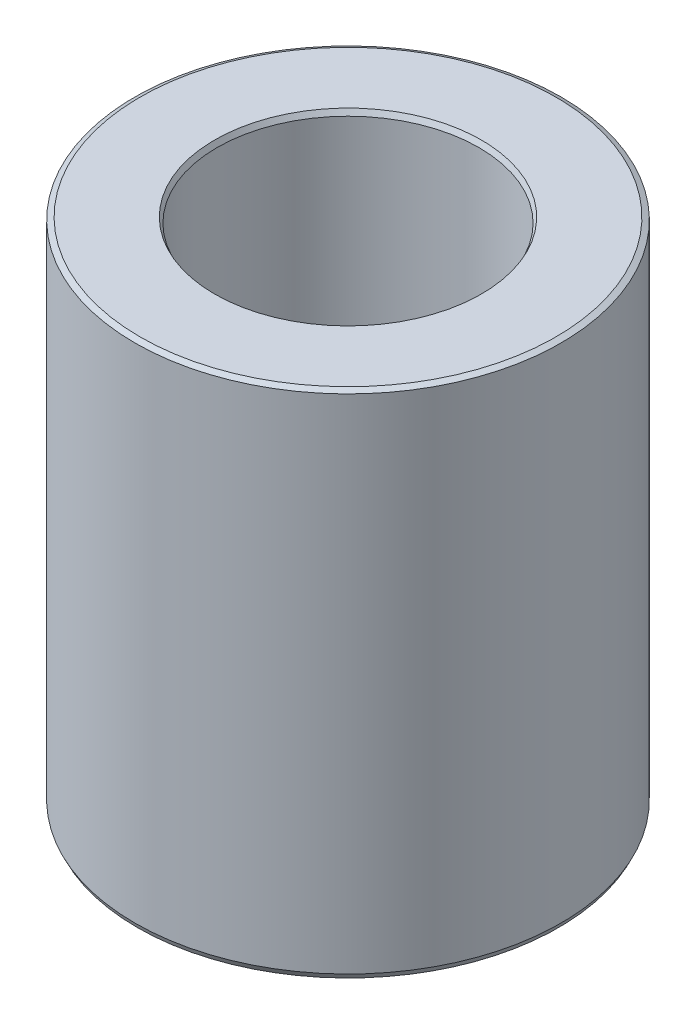
ISO-10303-21;
HEADER;
FILE_DESCRIPTION(('STEP AP214'),'2;1');
FILE_NAME('part.step','',(''),(''),'','','');
FILE_SCHEMA(('AUTOMOTIVE_DESIGN { 1 0 10303 214 1 1 1 1 }'));
ENDSEC;
DATA;
#1=APPLICATION_CONTEXT('core data for automotive mechanical design processes');
#2=APPLICATION_PROTOCOL_DEFINITION('international standard','automotive_design',2000,#1);
#3=PRODUCT_CONTEXT('',#1,'mechanical');
#4=PRODUCT('Part','Part','',(#3));
#5=PRODUCT_RELATED_PRODUCT_CATEGORY('part','',(#4));
#6=PRODUCT_DEFINITION_FORMATION('','',#4);
#7=PRODUCT_DEFINITION_CONTEXT('part definition',#1,'design');
#8=PRODUCT_DEFINITION('design','',#6,#7);
#9=PRODUCT_DEFINITION_SHAPE('','',#8);
#10=(LENGTH_UNIT() NAMED_UNIT(*) SI_UNIT(.MILLI.,.METRE.));
#11=(NAMED_UNIT(*) PLANE_ANGLE_UNIT() SI_UNIT($,.RADIAN.));
#12=(NAMED_UNIT(*) SI_UNIT($,.STERADIAN.) SOLID_ANGLE_UNIT());
#13=UNCERTAINTY_MEASURE_WITH_UNIT(LENGTH_MEASURE(1.E-05),#10,'distance_accuracy_value','');
#14=(GEOMETRIC_REPRESENTATION_CONTEXT(3) GLOBAL_UNCERTAINTY_ASSIGNED_CONTEXT((#13)) GLOBAL_UNIT_ASSIGNED_CONTEXT((#10,
#11,#12)) REPRESENTATION_CONTEXT('',''));
#15=CARTESIAN_POINT('',(0.,0.,0.));
#16=DIRECTION('',(0.,0.,1.));
#17=DIRECTION('',(1.,0.,0.));
#18=AXIS2_PLACEMENT_3D('',#15,#16,#17);
#19=CARTESIAN_POINT('',(0.,143.663507820876,0.));
#20=DIRECTION('',(0.,-1.,0.));
#21=DIRECTION('',(0.,0.,-1.));
#22=AXIS2_PLACEMENT_3D('',#19,#20,#21);
#23=CYLINDRICAL_SURFACE('',#22,60.);
#24=CARTESIAN_POINT('',(0.,1.47878063690801,0.));
#25=DIRECTION('',(0.,1.,0.));
#26=DIRECTION('',(0.,0.,1.));
#27=AXIS2_PLACEMENT_3D('',#24,#25,#26);
#28=CIRCLE('',#27,60.);
#29=CARTESIAN_POINT('',(0.,1.47878063690801,60.));
#30=VERTEX_POINT('',#29);
#31=EDGE_CURVE('E10',#30,#30,#28,.T.);
#32=ORIENTED_EDGE('',*,*,#31,.T.);
#33=EDGE_LOOP('',(#32));
#34=FACE_BOUND('',#33,.T.);
#35=CARTESIAN_POINT('',(0.,142.946231781575,0.));
#36=DIRECTION('',(0.,1.,0.));
#37=DIRECTION('',(0.,0.,1.));
#38=AXIS2_PLACEMENT_3D('',#35,#36,#37);
#39=CIRCLE('',#38,60.);
#40=CARTESIAN_POINT('',(0.,142.946231781575,60.));
#41=VERTEX_POINT('',#40);
#42=EDGE_CURVE('E50',#41,#41,#39,.F.);
#43=ORIENTED_EDGE('',*,*,#42,.T.);
#44=EDGE_LOOP('',(#43));
#45=FACE_BOUND('',#44,.T.);
#46=ADVANCED_FACE('F39',(#34,#45),#23,.T.);
#47=CARTESIAN_POINT('',(0.,143.663507820876,0.));
#48=DIRECTION('',(0.,1.,0.));
#49=DIRECTION('',(0.,0.,1.));
#50=AXIS2_PLACEMENT_3D('',#47,#48,#49);
#51=PLANE('',#50);
#52=CARTESIAN_POINT('',(0.,143.663507820876,0.));
#53=DIRECTION('',(0.,1.,0.));
#54=DIRECTION('',(0.,0.,1.));
#55=AXIS2_PLACEMENT_3D('',#52,#53,#54);
#56=CIRCLE('',#55,37.5738981580556);
#57=CARTESIAN_POINT('',(0.,143.663507820876,37.5738981580556));
#58=VERTEX_POINT('',#57);
#59=EDGE_CURVE('E58',#58,#58,#56,.F.);
#60=ORIENTED_EDGE('',*,*,#59,.T.);
#61=EDGE_LOOP('',(#60));
#62=FACE_BOUND('',#61,.T.);
#63=CARTESIAN_POINT('',(0.,143.663507820876,0.));
#64=DIRECTION('',(0.,1.,0.));
#65=DIRECTION('',(0.,0.,1.));
#66=AXIS2_PLACEMENT_3D('',#63,#64,#65);
#67=CIRCLE('',#66,58.5212193630918);
#68=CARTESIAN_POINT('',(0.,143.663507820876,58.5212193630918));
#69=VERTEX_POINT('',#68);
#70=EDGE_CURVE('E61',#69,#69,#67,.T.);
#71=ORIENTED_EDGE('',*,*,#70,.T.);
#72=EDGE_LOOP('',(#71));
#73=FACE_BOUND('',#72,.T.);
#74=ADVANCED_FACE('F88',(#62,#73),#51,.T.);
#75=CARTESIAN_POINT('',(0.,0.,0.));
#76=DIRECTION('',(0.,1.,0.));
#77=DIRECTION('',(0.,0.,1.));
#78=AXIS2_PLACEMENT_3D('',#75,#76,#77);
#79=PLANE('',#78);
#80=CARTESIAN_POINT('',(0.,0.,0.));
#81=DIRECTION('',(0.,1.,0.));
#82=DIRECTION('',(0.,0.,1.));
#83=AXIS2_PLACEMENT_3D('',#80,#81,#82);
#84=CIRCLE('',#83,38.335402755663);
#85=CARTESIAN_POINT('',(0.,0.,38.335402755663));
#86=VERTEX_POINT('',#85);
#87=EDGE_CURVE('E51',#86,#86,#84,.T.);
#88=ORIENTED_EDGE('',*,*,#87,.T.);
#89=EDGE_LOOP('',(#88));
#90=FACE_BOUND('',#89,.T.);
#91=CARTESIAN_POINT('',(0.,0.,0.));
#92=DIRECTION('',(0.,1.,0.));
#93=DIRECTION('',(0.,0.,1.));
#94=AXIS2_PLACEMENT_3D('',#91,#92,#93);
#95=CIRCLE('',#94,59.2827239606993);
#96=CARTESIAN_POINT('',(0.,0.,59.2827239606993));
#97=VERTEX_POINT('',#96);
#98=EDGE_CURVE('E54',#97,#97,#95,.F.);
#99=ORIENTED_EDGE('',*,*,#98,.T.);
#100=EDGE_LOOP('',(#99));
#101=FACE_BOUND('',#100,.T.);
#102=ADVANCED_FACE('F83',(#90,#101),#79,.F.);
#103=CARTESIAN_POINT('',(0.,143.663507820876,0.));
#104=DIRECTION('',(0.,-1.,0.));
#105=DIRECTION('',(0.,0.,-1.));
#106=AXIS2_PLACEMENT_3D('',#103,#104,#105);
#107=CYLINDRICAL_SURFACE('',#106,36.8566221187548);
#108=CARTESIAN_POINT('',(0.,142.184727183968,0.));
#109=DIRECTION('',(0.,1.,0.));
#110=DIRECTION('',(0.,0.,1.));
#111=AXIS2_PLACEMENT_3D('',#108,#109,#110);
#112=CIRCLE('',#111,36.8566221187548);
#113=CARTESIAN_POINT('',(0.,142.184727183968,36.8566221187548));
#114=VERTEX_POINT('',#113);
#115=EDGE_CURVE('E67',#114,#114,#112,.T.);
#116=ORIENTED_EDGE('',*,*,#115,.T.);
#117=EDGE_LOOP('',(#116));
#118=FACE_BOUND('',#117,.T.);
#119=CARTESIAN_POINT('',(0.,0.717276039300746,0.));
#120=DIRECTION('',(0.,1.,0.));
#121=DIRECTION('',(0.,0.,1.));
#122=AXIS2_PLACEMENT_3D('',#119,#120,#121);
#123=CIRCLE('',#122,36.8566221187548);
#124=CARTESIAN_POINT('',(0.,0.717276039300746,36.8566221187548));
#125=VERTEX_POINT('',#124);
#126=EDGE_CURVE('E69',#125,#125,#123,.F.);
#127=ORIENTED_EDGE('',*,*,#126,.T.);
#128=EDGE_LOOP('',(#127));
#129=FACE_BOUND('',#128,.T.);
#130=ADVANCED_FACE('F71',(#118,#129),#107,.F.);
#131=CARTESIAN_POINT('',(0.,142.184727183968,0.));
#132=DIRECTION('',(0.,1.,0.));
#133=DIRECTION('',(0.,0.,1.));
#134=AXIS2_PLACEMENT_3D('',#131,#132,#133);
#135=CONICAL_SURFACE('',#134,36.8566221187548,0.451612675432726);
#136=ORIENTED_EDGE('',*,*,#59,.F.);
#137=EDGE_LOOP('',(#136));
#138=FACE_BOUND('',#137,.T.);
#139=ORIENTED_EDGE('',*,*,#115,.F.);
#140=EDGE_LOOP('',(#139));
#141=FACE_BOUND('',#140,.T.);
#142=ADVANCED_FACE('F77',(#138,#141),#135,.F.);
#143=CARTESIAN_POINT('',(0.,0.,0.));
#144=DIRECTION('',(0.,-1.,0.));
#145=DIRECTION('',(0.,0.,-1.));
#146=AXIS2_PLACEMENT_3D('',#143,#144,#145);
#147=CONICAL_SURFACE('',#146,38.335402755663,1.11918365136215);
#148=ORIENTED_EDGE('',*,*,#126,.F.);
#149=EDGE_LOOP('',(#148));
#150=FACE_BOUND('',#149,.T.);
#151=ORIENTED_EDGE('',*,*,#87,.F.);
#152=EDGE_LOOP('',(#151));
#153=FACE_BOUND('',#152,.T.);
#154=ADVANCED_FACE('F73',(#150,#153),#147,.F.);
#155=CARTESIAN_POINT('',(0.,1.47878063690801,0.));
#156=DIRECTION('',(0.,1.,0.));
#157=DIRECTION('',(0.,0.,1.));
#158=AXIS2_PLACEMENT_3D('',#155,#156,#157);
#159=CONICAL_SURFACE('',#158,60.,0.45161267543275);
#160=ORIENTED_EDGE('',*,*,#98,.F.);
#161=EDGE_LOOP('',(#160));
#162=FACE_BOUND('',#161,.T.);
#163=ORIENTED_EDGE('',*,*,#31,.F.);
#164=EDGE_LOOP('',(#163));
#165=FACE_BOUND('',#164,.T.);
#166=ADVANCED_FACE('F76',(#162,#165),#159,.T.);
#167=CARTESIAN_POINT('',(0.,143.663507820876,0.));
#168=DIRECTION('',(0.,-1.,0.));
#169=DIRECTION('',(0.,0.,-1.));
#170=AXIS2_PLACEMENT_3D('',#167,#168,#169);
#171=CONICAL_SURFACE('',#170,58.5212193630918,1.11918365136216);
#172=ORIENTED_EDGE('',*,*,#42,.F.);
#173=EDGE_LOOP('',(#172));
#174=FACE_BOUND('',#173,.T.);
#175=ORIENTED_EDGE('',*,*,#70,.F.);
#176=EDGE_LOOP('',(#175));
#177=FACE_BOUND('',#176,.T.);
#178=ADVANCED_FACE('F45',(#174,#177),#171,.T.);
#179=CLOSED_SHELL('',(#46,#74,#102,#130,#142,#154,#166,#178));
#180=MANIFOLD_SOLID_BREP('B2',#179);
#181=ADVANCED_BREP_SHAPE_REPRESENTATION('',(#18,#180),#14);
#182=SHAPE_DEFINITION_REPRESENTATION(#9,#181);
ENDSEC;
END-ISO-10303-21;
